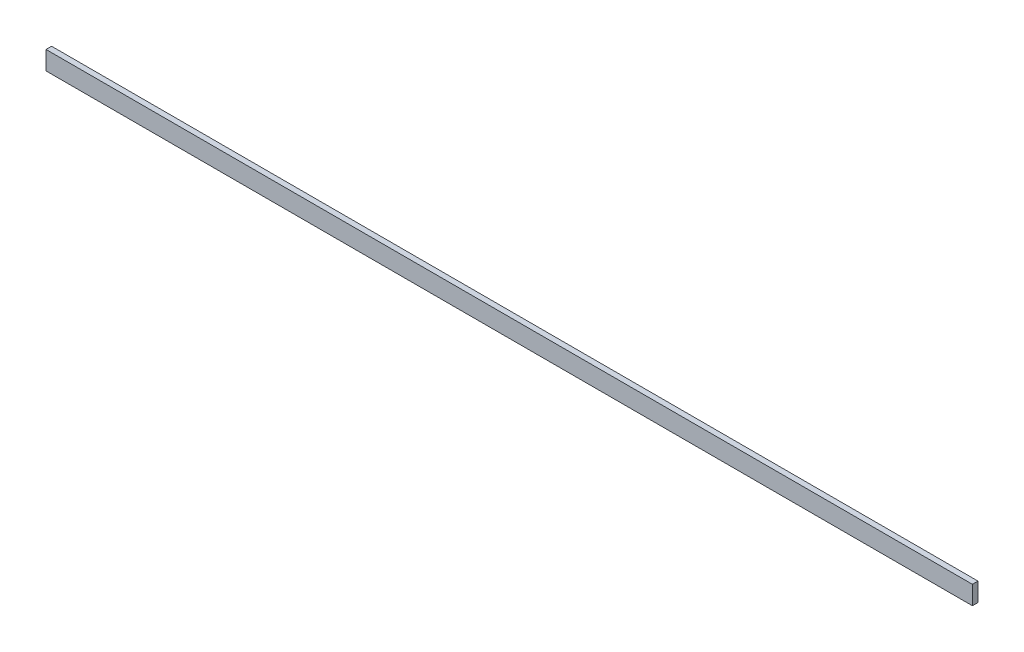
ISO-10303-21;
HEADER;
FILE_DESCRIPTION(('STEP AP214'),'2;1');
FILE_NAME('part.step','',(''),(''),'','','');
FILE_SCHEMA(('AUTOMOTIVE_DESIGN { 1 0 10303 214 1 1 1 1 }'));
ENDSEC;
DATA;
#1=APPLICATION_CONTEXT('core data for automotive mechanical design processes');
#2=APPLICATION_PROTOCOL_DEFINITION('international standard','automotive_design',2000,#1);
#3=PRODUCT_CONTEXT('',#1,'mechanical');
#4=PRODUCT('Part','Part','',(#3));
#5=PRODUCT_RELATED_PRODUCT_CATEGORY('part','',(#4));
#6=PRODUCT_DEFINITION_FORMATION('','',#4);
#7=PRODUCT_DEFINITION_CONTEXT('part definition',#1,'design');
#8=PRODUCT_DEFINITION('design','',#6,#7);
#9=PRODUCT_DEFINITION_SHAPE('','',#8);
#10=(LENGTH_UNIT() NAMED_UNIT(*) SI_UNIT(.MILLI.,.METRE.));
#11=(NAMED_UNIT(*) PLANE_ANGLE_UNIT() SI_UNIT($,.RADIAN.));
#12=(NAMED_UNIT(*) SI_UNIT($,.STERADIAN.) SOLID_ANGLE_UNIT());
#13=UNCERTAINTY_MEASURE_WITH_UNIT(LENGTH_MEASURE(1.E-05),#10,'distance_accuracy_value','');
#14=(GEOMETRIC_REPRESENTATION_CONTEXT(3) GLOBAL_UNCERTAINTY_ASSIGNED_CONTEXT((#13)) GLOBAL_UNIT_ASSIGNED_CONTEXT((#10,
#11,#12)) REPRESENTATION_CONTEXT('',''));
#15=CARTESIAN_POINT('',(0.,0.,0.));
#16=DIRECTION('',(0.,0.,1.));
#17=DIRECTION('',(1.,0.,0.));
#18=AXIS2_PLACEMENT_3D('',#15,#16,#17);
#19=CARTESIAN_POINT('',(0.,0.,-15.));
#20=DIRECTION('',(-1.,0.,0.));
#21=DIRECTION('',(0.,0.,1.));
#22=AXIS2_PLACEMENT_3D('',#19,#20,#21);
#23=PLANE('',#22);
#24=DIRECTION('',(0.,-1.,0.));
#25=VECTOR('',#24,1.);
#26=CARTESIAN_POINT('',(0.,0.,0.));
#27=LINE('',#26,#25);
#28=CARTESIAN_POINT('',(0.,0.,0.));
#29=VERTEX_POINT('',#28);
#30=CARTESIAN_POINT('',(0.,-50.,0.));
#31=VERTEX_POINT('',#30);
#32=EDGE_CURVE('E101',#29,#31,#27,.T.);
#33=ORIENTED_EDGE('',*,*,#32,.F.);
#34=DIRECTION('',(0.,0.,1.));
#35=VECTOR('',#34,1.);
#36=CARTESIAN_POINT('',(0.,0.,-15.));
#37=LINE('',#36,#35);
#38=CARTESIAN_POINT('',(0.,0.,-15.));
#39=VERTEX_POINT('',#38);
#40=EDGE_CURVE('E11',#39,#29,#37,.T.);
#41=ORIENTED_EDGE('',*,*,#40,.F.);
#42=DIRECTION('',(0.,-1.,0.));
#43=VECTOR('',#42,1.);
#44=CARTESIAN_POINT('',(0.,0.,-15.));
#45=LINE('',#44,#43);
#46=CARTESIAN_POINT('',(0.,-50.,-15.));
#47=VERTEX_POINT('',#46);
#48=EDGE_CURVE('E95',#39,#47,#45,.T.);
#49=ORIENTED_EDGE('',*,*,#48,.T.);
#50=DIRECTION('',(0.,0.,1.));
#51=VECTOR('',#50,1.);
#52=CARTESIAN_POINT('',(0.,-50.,-15.));
#53=LINE('',#52,#51);
#54=EDGE_CURVE('E40',#47,#31,#53,.T.);
#55=ORIENTED_EDGE('',*,*,#54,.T.);
#56=EDGE_LOOP('',(#33,#41,#49,#55));
#57=FACE_BOUND('',#56,.T.);
#58=ADVANCED_FACE('F37',(#57),#23,.T.);
#59=CARTESIAN_POINT('',(0.,0.,-15.));
#60=DIRECTION('',(0.,1.,0.));
#61=DIRECTION('',(0.,0.,1.));
#62=AXIS2_PLACEMENT_3D('',#59,#60,#61);
#63=PLANE('',#62);
#64=DIRECTION('',(-1.,0.,0.));
#65=VECTOR('',#64,1.);
#66=CARTESIAN_POINT('',(0.,0.,0.));
#67=LINE('',#66,#65);
#68=CARTESIAN_POINT('',(2490.,0.,0.));
#69=VERTEX_POINT('',#68);
#70=EDGE_CURVE('E97',#69,#29,#67,.T.);
#71=ORIENTED_EDGE('',*,*,#70,.F.);
#72=DIRECTION('',(0.,0.,1.));
#73=VECTOR('',#72,1.);
#74=CARTESIAN_POINT('',(2490.,0.,-15.));
#75=LINE('',#74,#73);
#76=CARTESIAN_POINT('',(2490.,0.,-15.));
#77=VERTEX_POINT('',#76);
#78=EDGE_CURVE('E46',#77,#69,#75,.T.);
#79=ORIENTED_EDGE('',*,*,#78,.F.);
#80=DIRECTION('',(-1.,0.,0.));
#81=VECTOR('',#80,1.);
#82=CARTESIAN_POINT('',(0.,0.,-15.));
#83=LINE('',#82,#81);
#84=EDGE_CURVE('E92',#77,#39,#83,.T.);
#85=ORIENTED_EDGE('',*,*,#84,.T.);
#86=ORIENTED_EDGE('',*,*,#40,.T.);
#87=EDGE_LOOP('',(#71,#79,#85,#86));
#88=FACE_BOUND('',#87,.T.);
#89=ADVANCED_FACE('F111',(#88),#63,.T.);
#90=CARTESIAN_POINT('',(2490.,0.,-15.));
#91=DIRECTION('',(1.,0.,0.));
#92=DIRECTION('',(0.,0.,-1.));
#93=AXIS2_PLACEMENT_3D('',#90,#91,#92);
#94=PLANE('',#93);
#95=DIRECTION('',(0.,1.,0.));
#96=VECTOR('',#95,1.);
#97=CARTESIAN_POINT('',(2490.,0.,0.));
#98=LINE('',#97,#96);
#99=CARTESIAN_POINT('',(2490.,-50.,0.));
#100=VERTEX_POINT('',#99);
#101=EDGE_CURVE('E87',#100,#69,#98,.T.);
#102=ORIENTED_EDGE('',*,*,#101,.F.);
#103=DIRECTION('',(0.,0.,1.));
#104=VECTOR('',#103,1.);
#105=CARTESIAN_POINT('',(2490.,-50.,-15.));
#106=LINE('',#105,#104);
#107=CARTESIAN_POINT('',(2490.,-50.,-15.));
#108=VERTEX_POINT('',#107);
#109=EDGE_CURVE('E82',#108,#100,#106,.T.);
#110=ORIENTED_EDGE('',*,*,#109,.F.);
#111=DIRECTION('',(0.,1.,0.));
#112=VECTOR('',#111,1.);
#113=CARTESIAN_POINT('',(2490.,0.,-15.));
#114=LINE('',#113,#112);
#115=EDGE_CURVE('E85',#108,#77,#114,.T.);
#116=ORIENTED_EDGE('',*,*,#115,.T.);
#117=ORIENTED_EDGE('',*,*,#78,.T.);
#118=EDGE_LOOP('',(#102,#110,#116,#117));
#119=FACE_BOUND('',#118,.T.);
#120=ADVANCED_FACE('F84',(#119),#94,.T.);
#121=CARTESIAN_POINT('',(0.,-50.,-15.));
#122=DIRECTION('',(0.,-1.,0.));
#123=DIRECTION('',(0.,0.,-1.));
#124=AXIS2_PLACEMENT_3D('',#121,#122,#123);
#125=PLANE('',#124);
#126=DIRECTION('',(1.,0.,0.));
#127=VECTOR('',#126,1.);
#128=CARTESIAN_POINT('',(0.,-50.,0.));
#129=LINE('',#128,#127);
#130=EDGE_CURVE('E104',#31,#100,#129,.T.);
#131=ORIENTED_EDGE('',*,*,#130,.F.);
#132=ORIENTED_EDGE('',*,*,#54,.F.);
#133=DIRECTION('',(1.,0.,0.));
#134=VECTOR('',#133,1.);
#135=CARTESIAN_POINT('',(0.,-50.,-15.));
#136=LINE('',#135,#134);
#137=EDGE_CURVE('E91',#47,#108,#136,.T.);
#138=ORIENTED_EDGE('',*,*,#137,.T.);
#139=ORIENTED_EDGE('',*,*,#109,.T.);
#140=EDGE_LOOP('',(#131,#132,#138,#139));
#141=FACE_BOUND('',#140,.T.);
#142=ADVANCED_FACE('F94',(#141),#125,.T.);
#143=CARTESIAN_POINT('',(0.,0.,-15.));
#144=DIRECTION('',(0.,0.,1.));
#145=DIRECTION('',(1.,0.,0.));
#146=AXIS2_PLACEMENT_3D('',#143,#144,#145);
#147=PLANE('',#146);
#148=ORIENTED_EDGE('',*,*,#48,.F.);
#149=ORIENTED_EDGE('',*,*,#84,.F.);
#150=ORIENTED_EDGE('',*,*,#115,.F.);
#151=ORIENTED_EDGE('',*,*,#137,.F.);
#152=EDGE_LOOP('',(#148,#149,#150,#151));
#153=FACE_BOUND('',#152,.T.);
#154=ADVANCED_FACE('F90',(#153),#147,.F.);
#155=CARTESIAN_POINT('',(0.,0.,0.));
#156=DIRECTION('',(0.,0.,1.));
#157=DIRECTION('',(1.,0.,0.));
#158=AXIS2_PLACEMENT_3D('',#155,#156,#157);
#159=PLANE('',#158);
#160=ORIENTED_EDGE('',*,*,#32,.T.);
#161=ORIENTED_EDGE('',*,*,#130,.T.);
#162=ORIENTED_EDGE('',*,*,#101,.T.);
#163=ORIENTED_EDGE('',*,*,#70,.T.);
#164=EDGE_LOOP('',(#160,#161,#162,#163));
#165=FACE_BOUND('',#164,.T.);
#166=ADVANCED_FACE('F110',(#165),#159,.T.);
#167=CLOSED_SHELL('',(#58,#89,#120,#142,#154,#166));
#168=MANIFOLD_SOLID_BREP('B2',#167);
#169=ADVANCED_BREP_SHAPE_REPRESENTATION('',(#18,#168),#14);
#170=SHAPE_DEFINITION_REPRESENTATION(#9,#169);
ENDSEC;
END-ISO-10303-21;
